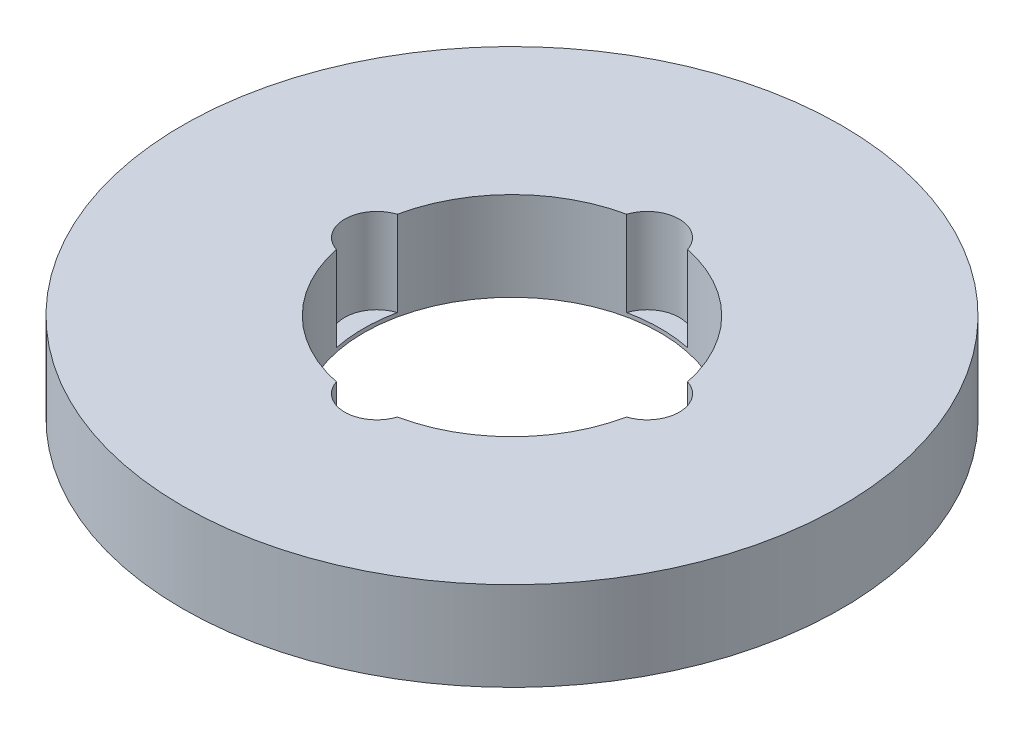
ISO-10303-21;
HEADER;
FILE_DESCRIPTION(('STEP AP214'),'2;1');
FILE_NAME('part.step','',(''),(''),'','','');
FILE_SCHEMA(('AUTOMOTIVE_DESIGN { 1 0 10303 214 1 1 1 1 }'));
ENDSEC;
DATA;
#1=APPLICATION_CONTEXT('core data for automotive mechanical design processes');
#2=APPLICATION_PROTOCOL_DEFINITION('international standard','automotive_design',2000,#1);
#3=PRODUCT_CONTEXT('',#1,'mechanical');
#4=PRODUCT('Part','Part','',(#3));
#5=PRODUCT_RELATED_PRODUCT_CATEGORY('part','',(#4));
#6=PRODUCT_DEFINITION_FORMATION('','',#4);
#7=PRODUCT_DEFINITION_CONTEXT('part definition',#1,'design');
#8=PRODUCT_DEFINITION('design','',#6,#7);
#9=PRODUCT_DEFINITION_SHAPE('','',#8);
#10=(LENGTH_UNIT() NAMED_UNIT(*) SI_UNIT(.MILLI.,.METRE.));
#11=(NAMED_UNIT(*) PLANE_ANGLE_UNIT() SI_UNIT($,.RADIAN.));
#12=(NAMED_UNIT(*) SI_UNIT($,.STERADIAN.) SOLID_ANGLE_UNIT());
#13=UNCERTAINTY_MEASURE_WITH_UNIT(LENGTH_MEASURE(1.E-05),#10,'distance_accuracy_value','');
#14=(GEOMETRIC_REPRESENTATION_CONTEXT(3) GLOBAL_UNCERTAINTY_ASSIGNED_CONTEXT((#13)) GLOBAL_UNIT_ASSIGNED_CONTEXT((#10,
#11,#12)) REPRESENTATION_CONTEXT('',''));
#15=CARTESIAN_POINT('',(0.,0.,0.));
#16=DIRECTION('',(0.,0.,1.));
#17=DIRECTION('',(1.,0.,0.));
#18=AXIS2_PLACEMENT_3D('',#15,#16,#17);
#19=CARTESIAN_POINT('',(0.,27.,0.));
#20=DIRECTION('',(0.,-1.,0.));
#21=DIRECTION('',(0.,0.,-1.));
#22=AXIS2_PLACEMENT_3D('',#19,#20,#21);
#23=CYLINDRICAL_SURFACE('',#22,100.);
#24=CARTESIAN_POINT('',(0.,27.,0.));
#25=DIRECTION('',(0.,1.,0.));
#26=DIRECTION('',(0.,0.,1.));
#27=AXIS2_PLACEMENT_3D('',#24,#25,#26);
#28=CIRCLE('',#27,100.);
#29=CARTESIAN_POINT('',(0.,27.,100.));
#30=VERTEX_POINT('',#29);
#31=EDGE_CURVE('E148',#30,#30,#28,.T.);
#32=ORIENTED_EDGE('',*,*,#31,.F.);
#33=EDGE_LOOP('',(#32));
#34=FACE_BOUND('',#33,.T.);
#35=CARTESIAN_POINT('',(0.,0.,0.));
#36=DIRECTION('',(0.,1.,0.));
#37=DIRECTION('',(0.,0.,1.));
#38=AXIS2_PLACEMENT_3D('',#35,#36,#37);
#39=CIRCLE('',#38,100.);
#40=CARTESIAN_POINT('',(0.,0.,100.));
#41=VERTEX_POINT('',#40);
#42=EDGE_CURVE('E139',#41,#41,#39,.T.);
#43=ORIENTED_EDGE('',*,*,#42,.T.);
#44=EDGE_LOOP('',(#43));
#45=FACE_BOUND('',#44,.T.);
#46=ADVANCED_FACE('F39',(#34,#45),#23,.T.);
#47=CARTESIAN_POINT('',(0.,27.,0.));
#48=DIRECTION('',(0.,1.,0.));
#49=DIRECTION('',(0.,0.,1.));
#50=AXIS2_PLACEMENT_3D('',#47,#48,#49);
#51=PLANE('',#50);
#52=CARTESIAN_POINT('',(1.43177561955904E-13,27.,41.0076835763197));
#53=DIRECTION('',(0.,1.,0.));
#54=DIRECTION('',(1.,0.,0.));
#55=AXIS2_PLACEMENT_3D('',#52,#53,#54);
#56=CIRCLE('',#55,9.74127352284131);
#57=CARTESIAN_POINT('',(-9.25816713730579,27.,44.0373289523526));
#58=VERTEX_POINT('',#57);
#59=CARTESIAN_POINT('',(9.2581671373061,27.,44.0373289523525));
#60=VERTEX_POINT('',#59);
#61=EDGE_CURVE('E175',#58,#60,#56,.T.);
#62=ORIENTED_EDGE('',*,*,#61,.F.);
#63=CARTESIAN_POINT('',(0.,27.,0.));
#64=DIRECTION('',(0.,1.,0.));
#65=DIRECTION('',(0.,0.,1.));
#66=AXIS2_PLACEMENT_3D('',#63,#64,#65);
#67=CIRCLE('',#66,45.);
#68=CARTESIAN_POINT('',(-44.0373289523526,27.,9.25816713730594));
#69=VERTEX_POINT('',#68);
#70=EDGE_CURVE('E134',#69,#58,#67,.T.);
#71=ORIENTED_EDGE('',*,*,#70,.F.);
#72=CARTESIAN_POINT('',(-41.0076835763197,27.,0.));
#73=DIRECTION('',(0.,1.,0.));
#74=DIRECTION('',(0.,0.,1.));
#75=AXIS2_PLACEMENT_3D('',#72,#73,#74);
#76=CIRCLE('',#75,9.74127352284131);
#77=CARTESIAN_POINT('',(-44.0373289523526,27.,-9.25816713730594));
#78=VERTEX_POINT('',#77);
#79=EDGE_CURVE('E143',#78,#69,#76,.T.);
#80=ORIENTED_EDGE('',*,*,#79,.F.);
#81=CARTESIAN_POINT('',(-9.25816713730641,27.,-44.0373289523525));
#82=VERTEX_POINT('',#81);
#83=EDGE_CURVE('E123',#82,#78,#67,.T.);
#84=ORIENTED_EDGE('',*,*,#83,.F.);
#85=CARTESIAN_POINT('',(-4.29532685867713E-13,27.,-41.0076835763197));
#86=DIRECTION('',(0.,1.,0.));
#87=DIRECTION('',(-1.,0.,0.));
#88=AXIS2_PLACEMENT_3D('',#85,#86,#87);
#89=CIRCLE('',#88,9.74127352284131);
#90=CARTESIAN_POINT('',(9.25816713730548,27.,-44.0373289523527));
#91=VERTEX_POINT('',#90);
#92=EDGE_CURVE('E106',#91,#82,#89,.T.);
#93=ORIENTED_EDGE('',*,*,#92,.F.);
#94=CARTESIAN_POINT('',(44.0373289523526,27.,-9.25816713730594));
#95=VERTEX_POINT('',#94);
#96=EDGE_CURVE('E125',#95,#91,#67,.T.);
#97=ORIENTED_EDGE('',*,*,#96,.F.);
#98=CARTESIAN_POINT('',(41.0076835763197,27.,0.));
#99=DIRECTION('',(0.,1.,0.));
#100=DIRECTION('',(0.,0.,-1.));
#101=AXIS2_PLACEMENT_3D('',#98,#99,#100);
#102=CIRCLE('',#101,9.74127352284131);
#103=CARTESIAN_POINT('',(44.0373289523526,27.,9.25816713730594));
#104=VERTEX_POINT('',#103);
#105=EDGE_CURVE('E286',#104,#95,#102,.T.);
#106=ORIENTED_EDGE('',*,*,#105,.F.);
#107=EDGE_CURVE('E135',#60,#104,#67,.T.);
#108=ORIENTED_EDGE('',*,*,#107,.F.);
#109=EDGE_LOOP('',(#62,#71,#80,#84,#93,#97,#106,#108));
#110=FACE_BOUND('',#109,.T.);
#111=ORIENTED_EDGE('',*,*,#31,.T.);
#112=EDGE_LOOP('',(#111));
#113=FACE_BOUND('',#112,.T.);
#114=ADVANCED_FACE('F118',(#110,#113),#51,.T.);
#115=CARTESIAN_POINT('',(0.,0.,0.));
#116=DIRECTION('',(0.,1.,0.));
#117=DIRECTION('',(0.,0.,1.));
#118=AXIS2_PLACEMENT_3D('',#115,#116,#117);
#119=PLANE('',#118);
#120=CARTESIAN_POINT('',(0.,0.,0.));
#121=DIRECTION('',(0.,1.,0.));
#122=DIRECTION('',(0.,0.,1.));
#123=AXIS2_PLACEMENT_3D('',#120,#121,#122);
#124=CIRCLE('',#123,45.);
#125=CARTESIAN_POINT('',(0.,0.,45.));
#126=VERTEX_POINT('',#125);
#127=EDGE_CURVE('E136',#126,#126,#124,.T.);
#128=ORIENTED_EDGE('',*,*,#127,.T.);
#129=EDGE_LOOP('',(#128));
#130=FACE_BOUND('',#129,.T.);
#131=ORIENTED_EDGE('',*,*,#42,.F.);
#132=EDGE_LOOP('',(#131));
#133=FACE_BOUND('',#132,.T.);
#134=ADVANCED_FACE('F187',(#130,#133),#119,.F.);
#135=CARTESIAN_POINT('',(0.,27.,0.));
#136=DIRECTION('',(0.,-1.,0.));
#137=DIRECTION('',(0.,0.,-1.));
#138=AXIS2_PLACEMENT_3D('',#135,#136,#137);
#139=CYLINDRICAL_SURFACE('',#138,45.);
#140=DIRECTION('',(0.,1.,0.));
#141=VECTOR('',#140,1.);
#142=CARTESIAN_POINT('',(-9.25816713730579,14.0811854649803,44.0373289523526));
#143=LINE('',#142,#141);
#144=CARTESIAN_POINT('',(-9.25816713730579,1.16237092996069,44.0373289523526));
#145=VERTEX_POINT('',#144);
#146=EDGE_CURVE('E11',#145,#58,#143,.T.);
#147=ORIENTED_EDGE('',*,*,#146,.F.);
#148=CARTESIAN_POINT('',(0.,1.16237092996069,0.));
#149=DIRECTION('',(0.,1.,0.));
#150=DIRECTION('',(0.,0.,1.));
#151=AXIS2_PLACEMENT_3D('',#148,#149,#150);
#152=CIRCLE('',#151,45.);
#153=CARTESIAN_POINT('',(9.2581671373061,1.16237092996069,44.0373289523525));
#154=VERTEX_POINT('',#153);
#155=EDGE_CURVE('E170',#145,#154,#152,.T.);
#156=ORIENTED_EDGE('',*,*,#155,.T.);
#157=DIRECTION('',(0.,1.,0.));
#158=VECTOR('',#157,1.);
#159=CARTESIAN_POINT('',(9.2581671373061,14.0811854649803,44.0373289523525));
#160=LINE('',#159,#158);
#161=EDGE_CURVE('E46',#60,#154,#160,.F.);
#162=ORIENTED_EDGE('',*,*,#161,.F.);
#163=ORIENTED_EDGE('',*,*,#107,.T.);
#164=DIRECTION('',(0.,1.,0.));
#165=VECTOR('',#164,1.);
#166=CARTESIAN_POINT('',(44.0373289523526,14.0811854649803,9.25816713730594));
#167=LINE('',#166,#165);
#168=CARTESIAN_POINT('',(44.0373289523526,1.16237092996069,9.25816713730594));
#169=VERTEX_POINT('',#168);
#170=EDGE_CURVE('E164',#169,#104,#167,.T.);
#171=ORIENTED_EDGE('',*,*,#170,.F.);
#172=CARTESIAN_POINT('',(0.,1.16237092996069,0.));
#173=DIRECTION('',(0.,1.,0.));
#174=DIRECTION('',(0.,0.,1.));
#175=AXIS2_PLACEMENT_3D('',#172,#173,#174);
#176=CIRCLE('',#175,45.);
#177=CARTESIAN_POINT('',(44.0373289523526,1.16237092996069,-9.25816713730594));
#178=VERTEX_POINT('',#177);
#179=EDGE_CURVE('E115',#169,#178,#176,.T.);
#180=ORIENTED_EDGE('',*,*,#179,.T.);
#181=DIRECTION('',(0.,1.,0.));
#182=VECTOR('',#181,1.);
#183=CARTESIAN_POINT('',(44.0373289523526,14.0811854649803,-9.25816713730594));
#184=LINE('',#183,#182);
#185=EDGE_CURVE('E131',#95,#178,#184,.F.);
#186=ORIENTED_EDGE('',*,*,#185,.F.);
#187=ORIENTED_EDGE('',*,*,#96,.T.);
#188=DIRECTION('',(0.,1.,0.));
#189=VECTOR('',#188,1.);
#190=CARTESIAN_POINT('',(9.25816713730548,14.0811854649803,-44.0373289523527));
#191=LINE('',#190,#189);
#192=CARTESIAN_POINT('',(9.25816713730548,1.16237092996069,-44.0373289523527));
#193=VERTEX_POINT('',#192);
#194=EDGE_CURVE('E105',#193,#91,#191,.T.);
#195=ORIENTED_EDGE('',*,*,#194,.F.);
#196=CARTESIAN_POINT('',(0.,1.16237092996069,0.));
#197=DIRECTION('',(0.,1.,0.));
#198=DIRECTION('',(0.,0.,1.));
#199=AXIS2_PLACEMENT_3D('',#196,#197,#198);
#200=CIRCLE('',#199,45.);
#201=CARTESIAN_POINT('',(-9.25816713730641,1.16237092996069,-44.0373289523525));
#202=VERTEX_POINT('',#201);
#203=EDGE_CURVE('E159',#193,#202,#200,.T.);
#204=ORIENTED_EDGE('',*,*,#203,.T.);
#205=DIRECTION('',(0.,1.,0.));
#206=VECTOR('',#205,1.);
#207=CARTESIAN_POINT('',(-9.2581671373064,14.0811854649803,-44.0373289523525));
#208=LINE('',#207,#206);
#209=EDGE_CURVE('E114',#82,#202,#208,.F.);
#210=ORIENTED_EDGE('',*,*,#209,.F.);
#211=ORIENTED_EDGE('',*,*,#83,.T.);
#212=DIRECTION('',(0.,1.,0.));
#213=VECTOR('',#212,1.);
#214=CARTESIAN_POINT('',(-44.0373289523526,14.0811854649803,-9.25816713730594));
#215=LINE('',#214,#213);
#216=CARTESIAN_POINT('',(-44.0373289523526,1.16237092996069,-9.25816713730594));
#217=VERTEX_POINT('',#216);
#218=EDGE_CURVE('E160',#217,#78,#215,.T.);
#219=ORIENTED_EDGE('',*,*,#218,.F.);
#220=CARTESIAN_POINT('',(0.,1.16237092996069,0.));
#221=DIRECTION('',(0.,1.,0.));
#222=DIRECTION('',(0.,0.,1.));
#223=AXIS2_PLACEMENT_3D('',#220,#221,#222);
#224=CIRCLE('',#223,45.);
#225=CARTESIAN_POINT('',(-44.0373289523526,1.16237092996069,9.25816713730594));
#226=VERTEX_POINT('',#225);
#227=EDGE_CURVE('E149',#217,#226,#224,.T.);
#228=ORIENTED_EDGE('',*,*,#227,.T.);
#229=DIRECTION('',(0.,1.,0.));
#230=VECTOR('',#229,1.);
#231=CARTESIAN_POINT('',(-44.0373289523526,14.0811854649803,9.25816713730594));
#232=LINE('',#231,#230);
#233=EDGE_CURVE('E152',#69,#226,#232,.F.);
#234=ORIENTED_EDGE('',*,*,#233,.F.);
#235=ORIENTED_EDGE('',*,*,#70,.T.);
#236=EDGE_LOOP('',(#147,#156,#162,#163,#171,#180,#186,#187,#195,#204,#210,#211,#219,#228,#234,#235));
#237=FACE_BOUND('',#236,.T.);
#238=ORIENTED_EDGE('',*,*,#127,.F.);
#239=EDGE_LOOP('',(#238));
#240=FACE_BOUND('',#239,.T.);
#241=ADVANCED_FACE('F126',(#237,#240),#139,.F.);
#242=CARTESIAN_POINT('',(-41.0076835763197,1.16237092996069,0.));
#243=DIRECTION('',(0.,1.,0.));
#244=DIRECTION('',(0.,0.,1.));
#245=AXIS2_PLACEMENT_3D('',#242,#243,#244);
#246=CYLINDRICAL_SURFACE('',#245,9.74127352284131);
#247=ORIENTED_EDGE('',*,*,#218,.T.);
#248=ORIENTED_EDGE('',*,*,#79,.T.);
#249=ORIENTED_EDGE('',*,*,#233,.T.);
#250=CARTESIAN_POINT('',(-41.0076835763197,1.16237092996069,0.));
#251=DIRECTION('',(0.,1.,0.));
#252=DIRECTION('',(0.,0.,1.));
#253=AXIS2_PLACEMENT_3D('',#250,#251,#252);
#254=CIRCLE('',#253,9.74127352284131);
#255=EDGE_CURVE('E144',#217,#226,#254,.T.);
#256=ORIENTED_EDGE('',*,*,#255,.F.);
#257=EDGE_LOOP('',(#247,#248,#249,#256));
#258=FACE_BOUND('',#257,.T.);
#259=ADVANCED_FACE('F200',(#258),#246,.F.);
#260=CARTESIAN_POINT('',(-41.0076835763197,1.16237092996069,0.));
#261=DIRECTION('',(0.,1.,0.));
#262=DIRECTION('',(0.,0.,1.));
#263=AXIS2_PLACEMENT_3D('',#260,#261,#262);
#264=PLANE('',#263);
#265=ORIENTED_EDGE('',*,*,#255,.T.);
#266=ORIENTED_EDGE('',*,*,#227,.F.);
#267=EDGE_LOOP('',(#265,#266));
#268=FACE_BOUND('',#267,.T.);
#269=ADVANCED_FACE('F201',(#268),#264,.T.);
#270=CARTESIAN_POINT('',(-4.29532685867713E-13,1.16237092996069,-41.0076835763197));
#271=DIRECTION('',(0.,1.,0.));
#272=DIRECTION('',(0.,0.,1.));
#273=AXIS2_PLACEMENT_3D('',#270,#271,#272);
#274=CYLINDRICAL_SURFACE('',#273,9.74127352284131);
#275=ORIENTED_EDGE('',*,*,#194,.T.);
#276=ORIENTED_EDGE('',*,*,#92,.T.);
#277=ORIENTED_EDGE('',*,*,#209,.T.);
#278=CARTESIAN_POINT('',(-4.29532685867713E-13,1.16237092996069,-41.0076835763197));
#279=DIRECTION('',(0.,1.,0.));
#280=DIRECTION('',(-1.,0.,0.));
#281=AXIS2_PLACEMENT_3D('',#278,#279,#280);
#282=CIRCLE('',#281,9.74127352284131);
#283=EDGE_CURVE('E107',#193,#202,#282,.T.);
#284=ORIENTED_EDGE('',*,*,#283,.F.);
#285=EDGE_LOOP('',(#275,#276,#277,#284));
#286=FACE_BOUND('',#285,.T.);
#287=ADVANCED_FACE('F102',(#286),#274,.F.);
#288=CARTESIAN_POINT('',(-4.29532685867713E-13,1.16237092996069,-41.0076835763197));
#289=DIRECTION('',(0.,1.,0.));
#290=DIRECTION('',(-1.,0.,0.));
#291=AXIS2_PLACEMENT_3D('',#288,#289,#290);
#292=PLANE('',#291);
#293=ORIENTED_EDGE('',*,*,#283,.T.);
#294=ORIENTED_EDGE('',*,*,#203,.F.);
#295=EDGE_LOOP('',(#293,#294));
#296=FACE_BOUND('',#295,.T.);
#297=ADVANCED_FACE('F209',(#296),#292,.T.);
#298=CARTESIAN_POINT('',(41.0076835763197,1.16237092996069,0.));
#299=DIRECTION('',(0.,1.,0.));
#300=DIRECTION('',(0.,0.,1.));
#301=AXIS2_PLACEMENT_3D('',#298,#299,#300);
#302=CYLINDRICAL_SURFACE('',#301,9.74127352284131);
#303=ORIENTED_EDGE('',*,*,#170,.T.);
#304=ORIENTED_EDGE('',*,*,#105,.T.);
#305=ORIENTED_EDGE('',*,*,#185,.T.);
#306=CARTESIAN_POINT('',(41.0076835763197,1.16237092996069,0.));
#307=DIRECTION('',(0.,1.,0.));
#308=DIRECTION('',(0.,0.,-1.));
#309=AXIS2_PLACEMENT_3D('',#306,#307,#308);
#310=CIRCLE('',#309,9.74127352284131);
#311=EDGE_CURVE('E56',#169,#178,#310,.T.);
#312=ORIENTED_EDGE('',*,*,#311,.F.);
#313=EDGE_LOOP('',(#303,#304,#305,#312));
#314=FACE_BOUND('',#313,.T.);
#315=ADVANCED_FACE('F213',(#314),#302,.F.);
#316=CARTESIAN_POINT('',(41.0076835763197,1.16237092996069,0.));
#317=DIRECTION('',(0.,1.,0.));
#318=DIRECTION('',(0.,0.,-1.));
#319=AXIS2_PLACEMENT_3D('',#316,#317,#318);
#320=PLANE('',#319);
#321=ORIENTED_EDGE('',*,*,#311,.T.);
#322=ORIENTED_EDGE('',*,*,#179,.F.);
#323=EDGE_LOOP('',(#321,#322));
#324=FACE_BOUND('',#323,.T.);
#325=ADVANCED_FACE('F179',(#324),#320,.T.);
#326=CARTESIAN_POINT('',(1.43177561955904E-13,1.16237092996069,41.0076835763197));
#327=DIRECTION('',(0.,1.,0.));
#328=DIRECTION('',(0.,0.,1.));
#329=AXIS2_PLACEMENT_3D('',#326,#327,#328);
#330=CYLINDRICAL_SURFACE('',#329,9.74127352284131);
#331=ORIENTED_EDGE('',*,*,#146,.T.);
#332=ORIENTED_EDGE('',*,*,#61,.T.);
#333=ORIENTED_EDGE('',*,*,#161,.T.);
#334=CARTESIAN_POINT('',(1.43177561955904E-13,1.16237092996069,41.0076835763197));
#335=DIRECTION('',(0.,1.,0.));
#336=DIRECTION('',(1.,0.,0.));
#337=AXIS2_PLACEMENT_3D('',#334,#335,#336);
#338=CIRCLE('',#337,9.74127352284131);
#339=EDGE_CURVE('E55',#145,#154,#338,.T.);
#340=ORIENTED_EDGE('',*,*,#339,.F.);
#341=EDGE_LOOP('',(#331,#332,#333,#340));
#342=FACE_BOUND('',#341,.T.);
#343=ADVANCED_FACE('F171',(#342),#330,.F.);
#344=CARTESIAN_POINT('',(1.43177561955904E-13,1.16237092996069,41.0076835763197));
#345=DIRECTION('',(0.,1.,0.));
#346=DIRECTION('',(1.,0.,0.));
#347=AXIS2_PLACEMENT_3D('',#344,#345,#346);
#348=PLANE('',#347);
#349=ORIENTED_EDGE('',*,*,#339,.T.);
#350=ORIENTED_EDGE('',*,*,#155,.F.);
#351=EDGE_LOOP('',(#349,#350));
#352=FACE_BOUND('',#351,.T.);
#353=ADVANCED_FACE('F173',(#352),#348,.T.);
#354=CLOSED_SHELL('',(#46,#114,#134,#241,#259,#269,#287,#297,#315,#325,#343,#353));
#355=MANIFOLD_SOLID_BREP('B2',#354);
#356=ADVANCED_BREP_SHAPE_REPRESENTATION('',(#18,#355),#14);
#357=SHAPE_DEFINITION_REPRESENTATION(#9,#356);
ENDSEC;
END-ISO-10303-21;
